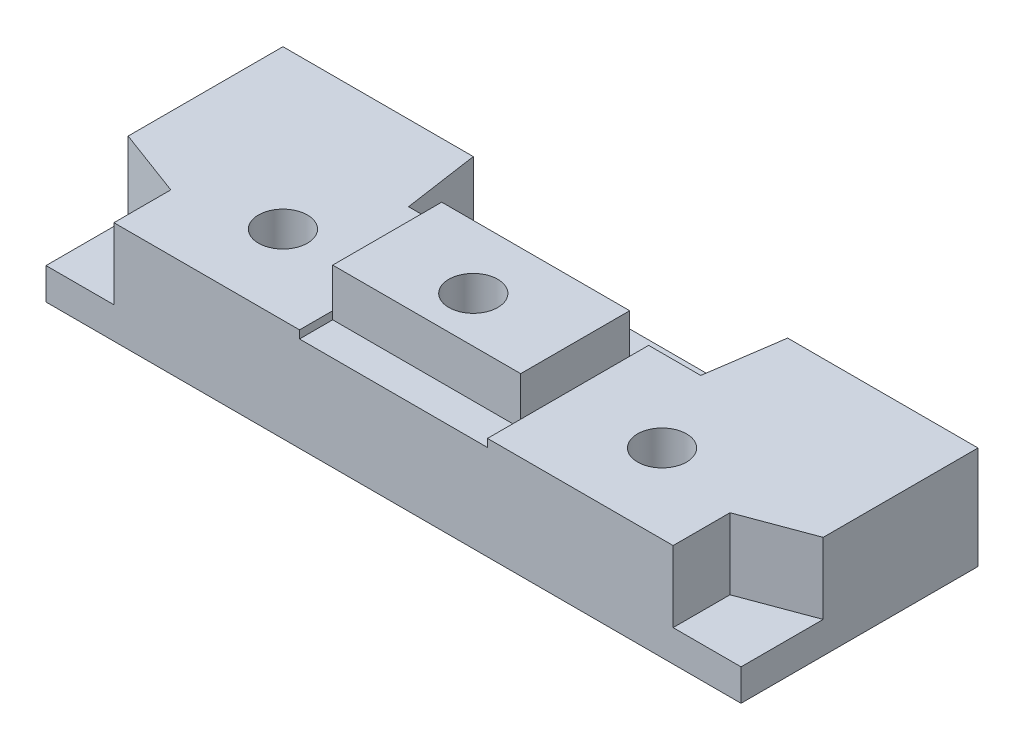
ISO-10303-21;
HEADER;
FILE_DESCRIPTION(('STEP AP214'),'2;1');
FILE_NAME('part.step','',(''),(''),'','','');
FILE_SCHEMA(('AUTOMOTIVE_DESIGN { 1 0 10303 214 1 1 1 1 }'));
ENDSEC;
DATA;
#1=APPLICATION_CONTEXT('core data for automotive mechanical design processes');
#2=APPLICATION_PROTOCOL_DEFINITION('international standard','automotive_design',2000,#1);
#3=PRODUCT_CONTEXT('',#1,'mechanical');
#4=PRODUCT('Part','Part','',(#3));
#5=PRODUCT_RELATED_PRODUCT_CATEGORY('part','',(#4));
#6=PRODUCT_DEFINITION_FORMATION('','',#4);
#7=PRODUCT_DEFINITION_CONTEXT('part definition',#1,'design');
#8=PRODUCT_DEFINITION('design','',#6,#7);
#9=PRODUCT_DEFINITION_SHAPE('','',#8);
#10=(LENGTH_UNIT() NAMED_UNIT(*) SI_UNIT(.MILLI.,.METRE.));
#11=(NAMED_UNIT(*) PLANE_ANGLE_UNIT() SI_UNIT($,.RADIAN.));
#12=(NAMED_UNIT(*) SI_UNIT($,.STERADIAN.) SOLID_ANGLE_UNIT());
#13=UNCERTAINTY_MEASURE_WITH_UNIT(LENGTH_MEASURE(1.E-05),#10,'distance_accuracy_value','');
#14=(GEOMETRIC_REPRESENTATION_CONTEXT(3) GLOBAL_UNCERTAINTY_ASSIGNED_CONTEXT((#13)) GLOBAL_UNIT_ASSIGNED_CONTEXT((#10,
#11,#12)) REPRESENTATION_CONTEXT('',''));
#15=CARTESIAN_POINT('',(0.,0.,0.));
#16=DIRECTION('',(0.,0.,1.));
#17=DIRECTION('',(1.,0.,0.));
#18=AXIS2_PLACEMENT_3D('',#15,#16,#17);
#19=CARTESIAN_POINT('',(16.05,9.,0.));
#20=DIRECTION('',(1.,0.,0.));
#21=DIRECTION('',(0.,0.,-1.));
#22=AXIS2_PLACEMENT_3D('',#19,#20,#21);
#23=PLANE('',#22);
#24=DIRECTION('',(0.,0.,1.));
#25=VECTOR('',#24,1.);
#26=CARTESIAN_POINT('',(16.05,6.5,4.80000000000001));
#27=LINE('',#26,#25);
#28=CARTESIAN_POINT('',(16.05,6.5,6.00000000000001));
#29=VERTEX_POINT('',#28);
#30=CARTESIAN_POINT('',(16.05,6.5,12.9));
#31=VERTEX_POINT('',#30);
#32=EDGE_CURVE('E310',#29,#31,#27,.T.);
#33=ORIENTED_EDGE('',*,*,#32,.T.);
#34=DIRECTION('',(0.,1.,0.));
#35=VECTOR('',#34,1.);
#36=CARTESIAN_POINT('',(16.05,6.,12.9));
#37=LINE('',#36,#35);
#38=CARTESIAN_POINT('',(16.05,9.,12.9));
#39=VERTEX_POINT('',#38);
#40=EDGE_CURVE('E335',#31,#39,#37,.T.);
#41=ORIENTED_EDGE('',*,*,#40,.T.);
#42=DIRECTION('',(0.,0.,1.));
#43=VECTOR('',#42,1.);
#44=CARTESIAN_POINT('',(16.05,9.,0.));
#45=LINE('',#44,#43);
#46=CARTESIAN_POINT('',(16.05,9.,6.00000000000001));
#47=VERTEX_POINT('',#46);
#48=EDGE_CURVE('E414',#47,#39,#45,.T.);
#49=ORIENTED_EDGE('',*,*,#48,.F.);
#50=DIRECTION('',(0.,1.,0.));
#51=VECTOR('',#50,1.);
#52=CARTESIAN_POINT('',(16.05,2.,6.00000000000001));
#53=LINE('',#52,#51);
#54=EDGE_CURVE('E347',#29,#47,#53,.T.);
#55=ORIENTED_EDGE('',*,*,#54,.F.);
#56=EDGE_LOOP('',(#33,#41,#49,#55));
#57=FACE_BOUND('',#56,.T.);
#58=ADVANCED_FACE('F87',(#57),#23,.F.);
#59=CARTESIAN_POINT('',(0.,5.,15.));
#60=DIRECTION('',(0.,0.,-1.));
#61=DIRECTION('',(-1.,0.,0.));
#62=AXIS2_PLACEMENT_3D('',#59,#60,#61);
#63=PLANE('',#62);
#64=DIRECTION('',(0.,1.,0.));
#65=VECTOR('',#64,1.);
#66=CARTESIAN_POINT('',(39.7,2.,15.));
#67=LINE('',#66,#65);
#68=CARTESIAN_POINT('',(39.7,2.,15.));
#69=VERTEX_POINT('',#68);
#70=CARTESIAN_POINT('',(39.7,6.5,15.));
#71=VERTEX_POINT('',#70);
#72=EDGE_CURVE('E251',#69,#71,#67,.T.);
#73=ORIENTED_EDGE('',*,*,#72,.T.);
#74=DIRECTION('',(1.,0.,0.));
#75=VECTOR('',#74,1.);
#76=CARTESIAN_POINT('',(27.95,6.5,15.));
#77=LINE('',#76,#75);
#78=CARTESIAN_POINT('',(27.95,6.5,15.));
#79=VERTEX_POINT('',#78);
#80=EDGE_CURVE('E255',#79,#71,#77,.T.);
#81=ORIENTED_EDGE('',*,*,#80,.F.);
#82=DIRECTION('',(0.,-1.,0.));
#83=VECTOR('',#82,1.);
#84=CARTESIAN_POINT('',(27.95,6.5,15.));
#85=LINE('',#84,#83);
#86=CARTESIAN_POINT('',(27.95,6.,15.));
#87=VERTEX_POINT('',#86);
#88=EDGE_CURVE('E273',#79,#87,#85,.T.);
#89=ORIENTED_EDGE('',*,*,#88,.T.);
#90=DIRECTION('',(1.,0.,0.));
#91=VECTOR('',#90,1.);
#92=CARTESIAN_POINT('',(16.05,6.,15.));
#93=LINE('',#92,#91);
#94=CARTESIAN_POINT('',(16.05,6.,15.));
#95=VERTEX_POINT('',#94);
#96=EDGE_CURVE('E322',#95,#87,#93,.T.);
#97=ORIENTED_EDGE('',*,*,#96,.F.);
#98=DIRECTION('',(0.,-1.,0.));
#99=VECTOR('',#98,1.);
#100=CARTESIAN_POINT('',(16.05,6.5,15.));
#101=LINE('',#100,#99);
#102=CARTESIAN_POINT('',(16.05,6.5,15.));
#103=VERTEX_POINT('',#102);
#104=EDGE_CURVE('E316',#103,#95,#101,.T.);
#105=ORIENTED_EDGE('',*,*,#104,.F.);
#106=DIRECTION('',(-1.,0.,0.));
#107=VECTOR('',#106,1.);
#108=CARTESIAN_POINT('',(16.05,6.5,15.));
#109=LINE('',#108,#107);
#110=CARTESIAN_POINT('',(4.3,6.5,15.));
#111=VERTEX_POINT('',#110);
#112=EDGE_CURVE('E309',#103,#111,#109,.T.);
#113=ORIENTED_EDGE('',*,*,#112,.T.);
#114=DIRECTION('',(0.,1.,0.));
#115=VECTOR('',#114,1.);
#116=CARTESIAN_POINT('',(4.3,2.,15.));
#117=LINE('',#116,#115);
#118=CARTESIAN_POINT('',(4.3,2.,15.));
#119=VERTEX_POINT('',#118);
#120=EDGE_CURVE('E364',#119,#111,#117,.T.);
#121=ORIENTED_EDGE('',*,*,#120,.F.);
#122=DIRECTION('',(1.,0.,0.));
#123=VECTOR('',#122,1.);
#124=CARTESIAN_POINT('',(0.,2.,15.));
#125=LINE('',#124,#123);
#126=CARTESIAN_POINT('',(0.,2.,15.));
#127=VERTEX_POINT('',#126);
#128=EDGE_CURVE('E357',#127,#119,#125,.T.);
#129=ORIENTED_EDGE('',*,*,#128,.F.);
#130=DIRECTION('',(0.,-1.,0.));
#131=VECTOR('',#130,1.);
#132=CARTESIAN_POINT('',(0.,5.,15.));
#133=LINE('',#132,#131);
#134=CARTESIAN_POINT('',(0.,0.,15.));
#135=VERTEX_POINT('',#134);
#136=EDGE_CURVE('E12',#127,#135,#133,.T.);
#137=ORIENTED_EDGE('',*,*,#136,.T.);
#138=DIRECTION('',(1.,0.,0.));
#139=VECTOR('',#138,1.);
#140=CARTESIAN_POINT('',(0.,0.,15.));
#141=LINE('',#140,#139);
#142=CARTESIAN_POINT('',(44.,0.,15.));
#143=VERTEX_POINT('',#142);
#144=EDGE_CURVE('E425',#135,#143,#141,.T.);
#145=ORIENTED_EDGE('',*,*,#144,.T.);
#146=DIRECTION('',(0.,-1.,0.));
#147=VECTOR('',#146,1.);
#148=CARTESIAN_POINT('',(44.,5.,15.));
#149=LINE('',#148,#147);
#150=CARTESIAN_POINT('',(44.,2.,15.));
#151=VERTEX_POINT('',#150);
#152=EDGE_CURVE('E95',#151,#143,#149,.T.);
#153=ORIENTED_EDGE('',*,*,#152,.F.);
#154=DIRECTION('',(1.,0.,0.));
#155=VECTOR('',#154,1.);
#156=CARTESIAN_POINT('',(44.,2.,15.));
#157=LINE('',#156,#155);
#158=EDGE_CURVE('E257',#69,#151,#157,.T.);
#159=ORIENTED_EDGE('',*,*,#158,.F.);
#160=EDGE_LOOP('',(#73,#81,#89,#97,#105,#113,#121,#129,#137,#145,#153,#159));
#161=FACE_BOUND('',#160,.T.);
#162=ADVANCED_FACE('F253',(#161),#63,.F.);
#163=CARTESIAN_POINT('',(0.,5.,0.));
#164=DIRECTION('',(0.,0.,1.));
#165=DIRECTION('',(1.,0.,0.));
#166=AXIS2_PLACEMENT_3D('',#163,#164,#165);
#167=PLANE('',#166);
#168=DIRECTION('',(0.,1.,0.));
#169=VECTOR('',#168,1.);
#170=CARTESIAN_POINT('',(12.05,2.,0.));
#171=LINE('',#170,#169);
#172=CARTESIAN_POINT('',(12.05,2.,0.));
#173=VERTEX_POINT('',#172);
#174=CARTESIAN_POINT('',(12.05,6.5,0.));
#175=VERTEX_POINT('',#174);
#176=EDGE_CURVE('E398',#173,#175,#171,.T.);
#177=ORIENTED_EDGE('',*,*,#176,.F.);
#178=DIRECTION('',(-1.,0.,0.));
#179=VECTOR('',#178,1.);
#180=CARTESIAN_POINT('',(31.95,2.,0.));
#181=LINE('',#180,#179);
#182=CARTESIAN_POINT('',(31.95,2.,0.));
#183=VERTEX_POINT('',#182);
#184=EDGE_CURVE('E383',#183,#173,#181,.T.);
#185=ORIENTED_EDGE('',*,*,#184,.F.);
#186=DIRECTION('',(0.,1.,0.));
#187=VECTOR('',#186,1.);
#188=CARTESIAN_POINT('',(31.95,2.,0.));
#189=LINE('',#188,#187);
#190=CARTESIAN_POINT('',(31.95,6.5,0.));
#191=VERTEX_POINT('',#190);
#192=EDGE_CURVE('E388',#183,#191,#189,.T.);
#193=ORIENTED_EDGE('',*,*,#192,.T.);
#194=DIRECTION('',(-1.,0.,0.));
#195=VECTOR('',#194,1.);
#196=CARTESIAN_POINT('',(44.,6.5,0.));
#197=LINE('',#196,#195);
#198=CARTESIAN_POINT('',(44.,6.5,0.));
#199=VERTEX_POINT('',#198);
#200=EDGE_CURVE('E508',#199,#191,#197,.T.);
#201=ORIENTED_EDGE('',*,*,#200,.F.);
#202=DIRECTION('',(0.,-1.,0.));
#203=VECTOR('',#202,1.);
#204=CARTESIAN_POINT('',(44.,5.,0.));
#205=LINE('',#204,#203);
#206=CARTESIAN_POINT('',(44.,0.,0.));
#207=VERTEX_POINT('',#206);
#208=EDGE_CURVE('E435',#199,#207,#205,.T.);
#209=ORIENTED_EDGE('',*,*,#208,.T.);
#210=DIRECTION('',(-1.,0.,0.));
#211=VECTOR('',#210,1.);
#212=CARTESIAN_POINT('',(0.,0.,0.));
#213=LINE('',#212,#211);
#214=CARTESIAN_POINT('',(0.,0.,0.));
#215=VERTEX_POINT('',#214);
#216=EDGE_CURVE('E430',#207,#215,#213,.T.);
#217=ORIENTED_EDGE('',*,*,#216,.T.);
#218=DIRECTION('',(0.,-1.,0.));
#219=VECTOR('',#218,1.);
#220=CARTESIAN_POINT('',(0.,5.,0.));
#221=LINE('',#220,#219);
#222=CARTESIAN_POINT('',(0.,6.5,0.));
#223=VERTEX_POINT('',#222);
#224=EDGE_CURVE('E432',#223,#215,#221,.T.);
#225=ORIENTED_EDGE('',*,*,#224,.F.);
#226=DIRECTION('',(1.,0.,0.));
#227=VECTOR('',#226,1.);
#228=CARTESIAN_POINT('',(0.,6.5,0.));
#229=LINE('',#228,#227);
#230=EDGE_CURVE('E296',#223,#175,#229,.T.);
#231=ORIENTED_EDGE('',*,*,#230,.T.);
#232=EDGE_LOOP('',(#177,#185,#193,#201,#209,#217,#225,#231));
#233=FACE_BOUND('',#232,.T.);
#234=ADVANCED_FACE('F450',(#233),#167,.F.);
#235=CARTESIAN_POINT('',(0.,5.,0.));
#236=DIRECTION('',(1.,0.,0.));
#237=DIRECTION('',(0.,0.,-1.));
#238=AXIS2_PLACEMENT_3D('',#235,#236,#237);
#239=PLANE('',#238);
#240=DIRECTION('',(0.,0.,1.));
#241=VECTOR('',#240,1.);
#242=CARTESIAN_POINT('',(0.,2.,9.8));
#243=LINE('',#242,#241);
#244=CARTESIAN_POINT('',(0.,2.,9.8));
#245=VERTEX_POINT('',#244);
#246=EDGE_CURVE('E110',#245,#127,#243,.T.);
#247=ORIENTED_EDGE('',*,*,#246,.F.);
#248=DIRECTION('',(0.,1.,0.));
#249=VECTOR('',#248,1.);
#250=CARTESIAN_POINT('',(0.,2.,9.8));
#251=LINE('',#250,#249);
#252=CARTESIAN_POINT('',(0.,6.5,9.8));
#253=VERTEX_POINT('',#252);
#254=EDGE_CURVE('E365',#245,#253,#251,.T.);
#255=ORIENTED_EDGE('',*,*,#254,.T.);
#256=DIRECTION('',(0.,0.,-1.));
#257=VECTOR('',#256,1.);
#258=CARTESIAN_POINT('',(0.,6.5,9.8));
#259=LINE('',#258,#257);
#260=EDGE_CURVE('E293',#253,#223,#259,.T.);
#261=ORIENTED_EDGE('',*,*,#260,.T.);
#262=ORIENTED_EDGE('',*,*,#224,.T.);
#263=DIRECTION('',(0.,0.,1.));
#264=VECTOR('',#263,1.);
#265=CARTESIAN_POINT('',(0.,0.,0.));
#266=LINE('',#265,#264);
#267=EDGE_CURVE('E422',#215,#135,#266,.T.);
#268=ORIENTED_EDGE('',*,*,#267,.T.);
#269=ORIENTED_EDGE('',*,*,#136,.F.);
#270=EDGE_LOOP('',(#247,#255,#261,#262,#268,#269));
#271=FACE_BOUND('',#270,.T.);
#272=ADVANCED_FACE('F89',(#271),#239,.F.);
#273=CARTESIAN_POINT('',(44.,5.,0.));
#274=DIRECTION('',(-1.,0.,0.));
#275=DIRECTION('',(0.,0.,1.));
#276=AXIS2_PLACEMENT_3D('',#273,#274,#275);
#277=PLANE('',#276);
#278=ORIENTED_EDGE('',*,*,#208,.F.);
#279=DIRECTION('',(0.,0.,-1.));
#280=VECTOR('',#279,1.);
#281=CARTESIAN_POINT('',(44.,6.5,9.79999999999998));
#282=LINE('',#281,#280);
#283=CARTESIAN_POINT('',(44.,6.5,9.79999999999998));
#284=VERTEX_POINT('',#283);
#285=EDGE_CURVE('E284',#284,#199,#282,.T.);
#286=ORIENTED_EDGE('',*,*,#285,.F.);
#287=DIRECTION('',(0.,1.,0.));
#288=VECTOR('',#287,1.);
#289=CARTESIAN_POINT('',(44.,2.,9.79999999999998));
#290=LINE('',#289,#288);
#291=CARTESIAN_POINT('',(44.,2.,9.79999999999998));
#292=VERTEX_POINT('',#291);
#293=EDGE_CURVE('E262',#292,#284,#290,.T.);
#294=ORIENTED_EDGE('',*,*,#293,.F.);
#295=DIRECTION('',(0.,0.,-1.));
#296=VECTOR('',#295,1.);
#297=CARTESIAN_POINT('',(44.,2.,9.79999999999998));
#298=LINE('',#297,#296);
#299=EDGE_CURVE('E375',#151,#292,#298,.T.);
#300=ORIENTED_EDGE('',*,*,#299,.F.);
#301=ORIENTED_EDGE('',*,*,#152,.T.);
#302=DIRECTION('',(0.,0.,-1.));
#303=VECTOR('',#302,1.);
#304=CARTESIAN_POINT('',(44.,0.,0.));
#305=LINE('',#304,#303);
#306=EDGE_CURVE('E428',#143,#207,#305,.T.);
#307=ORIENTED_EDGE('',*,*,#306,.T.);
#308=EDGE_LOOP('',(#278,#286,#294,#300,#301,#307));
#309=FACE_BOUND('',#308,.T.);
#310=ADVANCED_FACE('F439',(#309),#277,.F.);
#311=CARTESIAN_POINT('',(0.,0.,0.));
#312=DIRECTION('',(0.,1.,0.));
#313=DIRECTION('',(0.,0.,1.));
#314=AXIS2_PLACEMENT_3D('',#311,#312,#313);
#315=PLANE('',#314);
#316=ORIENTED_EDGE('',*,*,#267,.F.);
#317=ORIENTED_EDGE('',*,*,#216,.F.);
#318=ORIENTED_EDGE('',*,*,#306,.F.);
#319=ORIENTED_EDGE('',*,*,#144,.F.);
#320=EDGE_LOOP('',(#316,#317,#318,#319));
#321=FACE_BOUND('',#320,.T.);
#322=ADVANCED_FACE('F447',(#321),#315,.F.);
#323=CARTESIAN_POINT('',(27.95,9.,0.));
#324=DIRECTION('',(-1.,0.,0.));
#325=DIRECTION('',(0.,0.,1.));
#326=AXIS2_PLACEMENT_3D('',#323,#324,#325);
#327=PLANE('',#326);
#328=DIRECTION('',(0.,1.,0.));
#329=VECTOR('',#328,1.);
#330=CARTESIAN_POINT('',(27.95,6.,12.9));
#331=LINE('',#330,#329);
#332=CARTESIAN_POINT('',(27.95,6.5,12.9));
#333=VERTEX_POINT('',#332);
#334=CARTESIAN_POINT('',(27.95,9.,12.9));
#335=VERTEX_POINT('',#334);
#336=EDGE_CURVE('E102',#333,#335,#331,.T.);
#337=ORIENTED_EDGE('',*,*,#336,.F.);
#338=DIRECTION('',(0.,0.,1.));
#339=VECTOR('',#338,1.);
#340=CARTESIAN_POINT('',(27.95,6.5,4.8));
#341=LINE('',#340,#339);
#342=CARTESIAN_POINT('',(27.95,6.5,6.00000000000001));
#343=VERTEX_POINT('',#342);
#344=EDGE_CURVE('E496',#343,#333,#341,.T.);
#345=ORIENTED_EDGE('',*,*,#344,.F.);
#346=DIRECTION('',(0.,1.,0.));
#347=VECTOR('',#346,1.);
#348=CARTESIAN_POINT('',(27.95,2.,6.00000000000001));
#349=LINE('',#348,#347);
#350=CARTESIAN_POINT('',(27.95,9.,6.00000000000001));
#351=VERTEX_POINT('',#350);
#352=EDGE_CURVE('E353',#343,#351,#349,.T.);
#353=ORIENTED_EDGE('',*,*,#352,.T.);
#354=DIRECTION('',(0.,0.,-1.));
#355=VECTOR('',#354,1.);
#356=CARTESIAN_POINT('',(27.95,9.,0.));
#357=LINE('',#356,#355);
#358=EDGE_CURVE('E419',#335,#351,#357,.T.);
#359=ORIENTED_EDGE('',*,*,#358,.F.);
#360=EDGE_LOOP('',(#337,#345,#353,#359));
#361=FACE_BOUND('',#360,.T.);
#362=ADVANCED_FACE('F495',(#361),#327,.F.);
#363=CARTESIAN_POINT('',(0.,9.,0.));
#364=DIRECTION('',(0.,1.,0.));
#365=DIRECTION('',(0.,0.,1.));
#366=AXIS2_PLACEMENT_3D('',#363,#364,#365);
#367=PLANE('',#366);
#368=DIRECTION('',(-1.,0.,0.));
#369=VECTOR('',#368,1.);
#370=CARTESIAN_POINT('',(16.05,9.,12.9));
#371=LINE('',#370,#369);
#372=EDGE_CURVE('E318',#335,#39,#371,.T.);
#373=ORIENTED_EDGE('',*,*,#372,.F.);
#374=ORIENTED_EDGE('',*,*,#358,.T.);
#375=DIRECTION('',(1.,0.,0.));
#376=VECTOR('',#375,1.);
#377=CARTESIAN_POINT('',(16.05,9.,6.00000000000001));
#378=LINE('',#377,#376);
#379=EDGE_CURVE('E334',#47,#351,#378,.T.);
#380=ORIENTED_EDGE('',*,*,#379,.F.);
#381=ORIENTED_EDGE('',*,*,#48,.T.);
#382=EDGE_LOOP('',(#373,#374,#380,#381));
#383=FACE_BOUND('',#382,.T.);
#384=CARTESIAN_POINT('',(22.05,9.,10.));
#385=DIRECTION('',(0.,1.,0.));
#386=DIRECTION('',(0.,0.,1.));
#387=AXIS2_PLACEMENT_3D('',#384,#385,#386);
#388=CIRCLE('',#387,1.55);
#389=CARTESIAN_POINT('',(22.05,9.,11.55));
#390=VERTEX_POINT('',#389);
#391=EDGE_CURVE('E401',#390,#390,#388,.T.);
#392=ORIENTED_EDGE('',*,*,#391,.F.);
#393=EDGE_LOOP('',(#392));
#394=FACE_BOUND('',#393,.T.);
#395=ADVANCED_FACE('F486',(#383,#394),#367,.T.);
#396=CARTESIAN_POINT('',(22.05,6.,10.));
#397=DIRECTION('',(0.,1.,0.));
#398=DIRECTION('',(0.,0.,1.));
#399=AXIS2_PLACEMENT_3D('',#396,#397,#398);
#400=CYLINDRICAL_SURFACE('',#399,1.55);
#401=CARTESIAN_POINT('',(22.05,6.,10.));
#402=DIRECTION('',(0.,1.,0.));
#403=DIRECTION('',(0.,0.,1.));
#404=AXIS2_PLACEMENT_3D('',#401,#402,#403);
#405=CIRCLE('',#404,1.55);
#406=CARTESIAN_POINT('',(22.05,6.,11.55));
#407=VERTEX_POINT('',#406);
#408=EDGE_CURVE('E405',#407,#407,#405,.T.);
#409=ORIENTED_EDGE('',*,*,#408,.F.);
#410=EDGE_LOOP('',(#409));
#411=FACE_BOUND('',#410,.T.);
#412=ORIENTED_EDGE('',*,*,#391,.T.);
#413=EDGE_LOOP('',(#412));
#414=FACE_BOUND('',#413,.T.);
#415=ADVANCED_FACE('F588',(#411,#414),#400,.F.);
#416=CARTESIAN_POINT('',(22.05,6.,10.));
#417=DIRECTION('',(0.,1.,0.));
#418=DIRECTION('',(0.,0.,1.));
#419=AXIS2_PLACEMENT_3D('',#416,#417,#418);
#420=PLANE('',#419);
#421=ORIENTED_EDGE('',*,*,#408,.T.);
#422=EDGE_LOOP('',(#421));
#423=FACE_BOUND('',#422,.T.);
#424=ADVANCED_FACE('F633',(#423),#420,.T.);
#425=CARTESIAN_POINT('',(31.25,2.,4.8));
#426=DIRECTION('',(0.989532981063281,0.,0.144306893071728));
#427=DIRECTION('',(0.144306893071728,0.,-0.989532981063282));
#428=AXIS2_PLACEMENT_3D('',#425,#426,#427);
#429=PLANE('',#428);
#430=DIRECTION('',(0.,1.,0.));
#431=VECTOR('',#430,1.);
#432=CARTESIAN_POINT('',(31.25,2.,4.8));
#433=LINE('',#432,#431);
#434=CARTESIAN_POINT('',(31.25,2.,4.8));
#435=VERTEX_POINT('',#434);
#436=CARTESIAN_POINT('',(31.25,6.5,4.8));
#437=VERTEX_POINT('',#436);
#438=EDGE_CURVE('E373',#435,#437,#433,.T.);
#439=ORIENTED_EDGE('',*,*,#438,.T.);
#440=DIRECTION('',(-0.144306893071728,0.,0.989532981063281));
#441=VECTOR('',#440,1.);
#442=CARTESIAN_POINT('',(31.95,6.5,0.));
#443=LINE('',#442,#441);
#444=EDGE_CURVE('E505',#191,#437,#443,.T.);
#445=ORIENTED_EDGE('',*,*,#444,.F.);
#446=ORIENTED_EDGE('',*,*,#192,.F.);
#447=DIRECTION('',(0.144306893071728,0.,-0.989532981063281));
#448=VECTOR('',#447,1.);
#449=CARTESIAN_POINT('',(31.25,2.,4.8));
#450=LINE('',#449,#448);
#451=EDGE_CURVE('E352',#435,#183,#450,.T.);
#452=ORIENTED_EDGE('',*,*,#451,.F.);
#453=EDGE_LOOP('',(#439,#445,#446,#452));
#454=FACE_BOUND('',#453,.T.);
#455=ADVANCED_FACE('F516',(#454),#429,.F.);
#456=CARTESIAN_POINT('',(27.95,2.,4.8));
#457=DIRECTION('',(0.,0.,1.));
#458=DIRECTION('',(1.,0.,0.));
#459=AXIS2_PLACEMENT_3D('',#456,#457,#458);
#460=PLANE('',#459);
#461=DIRECTION('',(0.,1.,0.));
#462=VECTOR('',#461,1.);
#463=CARTESIAN_POINT('',(27.95,2.,4.8));
#464=LINE('',#463,#462);
#465=CARTESIAN_POINT('',(27.95,2.,4.8));
#466=VERTEX_POINT('',#465);
#467=CARTESIAN_POINT('',(27.95,6.5,4.8));
#468=VERTEX_POINT('',#467);
#469=EDGE_CURVE('E390',#466,#468,#464,.T.);
#470=ORIENTED_EDGE('',*,*,#469,.T.);
#471=DIRECTION('',(-1.,0.,0.));
#472=VECTOR('',#471,1.);
#473=CARTESIAN_POINT('',(31.25,6.5,4.8));
#474=LINE('',#473,#472);
#475=EDGE_CURVE('E500',#437,#468,#474,.T.);
#476=ORIENTED_EDGE('',*,*,#475,.F.);
#477=ORIENTED_EDGE('',*,*,#438,.F.);
#478=DIRECTION('',(1.,0.,0.));
#479=VECTOR('',#478,1.);
#480=CARTESIAN_POINT('',(27.95,2.,4.8));
#481=LINE('',#480,#479);
#482=EDGE_CURVE('E385',#466,#435,#481,.T.);
#483=ORIENTED_EDGE('',*,*,#482,.F.);
#484=EDGE_LOOP('',(#470,#476,#477,#483));
#485=FACE_BOUND('',#484,.T.);
#486=ADVANCED_FACE('F523',(#485),#460,.F.);
#487=CARTESIAN_POINT('',(0.,2.,0.));
#488=DIRECTION('',(0.,1.,0.));
#489=DIRECTION('',(0.,0.,1.));
#490=AXIS2_PLACEMENT_3D('',#487,#488,#489);
#491=PLANE('',#490);
#492=ORIENTED_EDGE('',*,*,#451,.T.);
#493=ORIENTED_EDGE('',*,*,#184,.T.);
#494=DIRECTION('',(0.144306893071729,0.,0.989532981063281));
#495=VECTOR('',#494,1.);
#496=CARTESIAN_POINT('',(12.75,2.,4.80000000000001));
#497=LINE('',#496,#495);
#498=CARTESIAN_POINT('',(12.75,2.,4.80000000000001));
#499=VERTEX_POINT('',#498);
#500=EDGE_CURVE('E367',#173,#499,#497,.T.);
#501=ORIENTED_EDGE('',*,*,#500,.T.);
#502=DIRECTION('',(1.,0.,0.));
#503=VECTOR('',#502,1.);
#504=CARTESIAN_POINT('',(16.05,2.,4.80000000000001));
#505=LINE('',#504,#503);
#506=CARTESIAN_POINT('',(16.05,2.,4.80000000000001));
#507=VERTEX_POINT('',#506);
#508=EDGE_CURVE('E395',#499,#507,#505,.T.);
#509=ORIENTED_EDGE('',*,*,#508,.T.);
#510=DIRECTION('',(0.,0.,1.));
#511=VECTOR('',#510,1.);
#512=CARTESIAN_POINT('',(16.05,2.,0.));
#513=LINE('',#512,#511);
#514=CARTESIAN_POINT('',(16.05,2.,6.00000000000001));
#515=VERTEX_POINT('',#514);
#516=EDGE_CURVE('E338',#507,#515,#513,.T.);
#517=ORIENTED_EDGE('',*,*,#516,.T.);
#518=DIRECTION('',(1.,0.,0.));
#519=VECTOR('',#518,1.);
#520=CARTESIAN_POINT('',(16.05,2.,6.00000000000001));
#521=LINE('',#520,#519);
#522=CARTESIAN_POINT('',(27.95,2.,6.00000000000001));
#523=VERTEX_POINT('',#522);
#524=EDGE_CURVE('E341',#515,#523,#521,.T.);
#525=ORIENTED_EDGE('',*,*,#524,.T.);
#526=DIRECTION('',(0.,0.,-1.));
#527=VECTOR('',#526,1.);
#528=CARTESIAN_POINT('',(27.95,2.,0.));
#529=LINE('',#528,#527);
#530=EDGE_CURVE('E344',#523,#466,#529,.T.);
#531=ORIENTED_EDGE('',*,*,#530,.T.);
#532=ORIENTED_EDGE('',*,*,#482,.T.);
#533=EDGE_LOOP('',(#492,#493,#501,#509,#517,#525,#531,#532));
#534=FACE_BOUND('',#533,.T.);
#535=ADVANCED_FACE('F518',(#534),#491,.T.);
#536=CARTESIAN_POINT('',(16.05,2.,4.80000000000001));
#537=DIRECTION('',(0.,0.,1.));
#538=DIRECTION('',(1.,0.,0.));
#539=AXIS2_PLACEMENT_3D('',#536,#537,#538);
#540=PLANE('',#539);
#541=DIRECTION('',(0.,1.,0.));
#542=VECTOR('',#541,1.);
#543=CARTESIAN_POINT('',(12.75,2.,4.80000000000001));
#544=LINE('',#543,#542);
#545=CARTESIAN_POINT('',(12.75,6.5,4.80000000000001));
#546=VERTEX_POINT('',#545);
#547=EDGE_CURVE('E402',#499,#546,#544,.T.);
#548=ORIENTED_EDGE('',*,*,#547,.T.);
#549=DIRECTION('',(1.,0.,0.));
#550=VECTOR('',#549,1.);
#551=CARTESIAN_POINT('',(12.75,6.5,4.80000000000001));
#552=LINE('',#551,#550);
#553=CARTESIAN_POINT('',(16.05,6.5,4.80000000000001));
#554=VERTEX_POINT('',#553);
#555=EDGE_CURVE('E302',#546,#554,#552,.T.);
#556=ORIENTED_EDGE('',*,*,#555,.T.);
#557=DIRECTION('',(0.,1.,0.));
#558=VECTOR('',#557,1.);
#559=CARTESIAN_POINT('',(16.05,2.,4.80000000000001));
#560=LINE('',#559,#558);
#561=EDGE_CURVE('E399',#507,#554,#560,.T.);
#562=ORIENTED_EDGE('',*,*,#561,.F.);
#563=ORIENTED_EDGE('',*,*,#508,.F.);
#564=EDGE_LOOP('',(#548,#556,#562,#563));
#565=FACE_BOUND('',#564,.T.);
#566=ADVANCED_FACE('F532',(#565),#540,.F.);
#567=CARTESIAN_POINT('',(12.75,2.,4.80000000000001));
#568=DIRECTION('',(-0.989532981063281,0.,0.144306893071729));
#569=DIRECTION('',(0.144306893071729,0.,0.989532981063281));
#570=AXIS2_PLACEMENT_3D('',#567,#568,#569);
#571=PLANE('',#570);
#572=ORIENTED_EDGE('',*,*,#176,.T.);
#573=DIRECTION('',(0.144306893071729,0.,0.989532981063281));
#574=VECTOR('',#573,1.);
#575=CARTESIAN_POINT('',(12.05,6.5,0.));
#576=LINE('',#575,#574);
#577=EDGE_CURVE('E299',#175,#546,#576,.T.);
#578=ORIENTED_EDGE('',*,*,#577,.T.);
#579=ORIENTED_EDGE('',*,*,#547,.F.);
#580=ORIENTED_EDGE('',*,*,#500,.F.);
#581=EDGE_LOOP('',(#572,#578,#579,#580));
#582=FACE_BOUND('',#581,.T.);
#583=ADVANCED_FACE('F535',(#582),#571,.F.);
#584=CARTESIAN_POINT('',(39.7,2.,15.));
#585=DIRECTION('',(-1.,0.,0.));
#586=DIRECTION('',(0.,0.,1.));
#587=AXIS2_PLACEMENT_3D('',#584,#585,#586);
#588=PLANE('',#587);
#589=DIRECTION('',(0.,1.,0.));
#590=VECTOR('',#589,1.);
#591=CARTESIAN_POINT('',(39.7,2.,11.4));
#592=LINE('',#591,#590);
#593=CARTESIAN_POINT('',(39.7,2.,11.4));
#594=VERTEX_POINT('',#593);
#595=CARTESIAN_POINT('',(39.7,6.5,11.4));
#596=VERTEX_POINT('',#595);
#597=EDGE_CURVE('E276',#594,#596,#592,.T.);
#598=ORIENTED_EDGE('',*,*,#597,.T.);
#599=DIRECTION('',(0.,0.,-1.));
#600=VECTOR('',#599,1.);
#601=CARTESIAN_POINT('',(39.7,6.5,15.));
#602=LINE('',#601,#600);
#603=EDGE_CURVE('E269',#71,#596,#602,.T.);
#604=ORIENTED_EDGE('',*,*,#603,.F.);
#605=ORIENTED_EDGE('',*,*,#72,.F.);
#606=DIRECTION('',(0.,0.,1.));
#607=VECTOR('',#606,1.);
#608=CARTESIAN_POINT('',(39.7,2.,15.));
#609=LINE('',#608,#607);
#610=EDGE_CURVE('E371',#594,#69,#609,.T.);
#611=ORIENTED_EDGE('',*,*,#610,.F.);
#612=EDGE_LOOP('',(#598,#604,#605,#611));
#613=FACE_BOUND('',#612,.T.);
#614=ADVANCED_FACE('F275',(#613),#588,.F.);
#615=CARTESIAN_POINT('',(39.7,2.,11.4));
#616=DIRECTION('',(-0.348733712021419,0.,-0.937221851057562));
#617=DIRECTION('',(-0.937221851057562,0.,0.348733712021419));
#618=AXIS2_PLACEMENT_3D('',#615,#616,#617);
#619=PLANE('',#618);
#620=ORIENTED_EDGE('',*,*,#293,.T.);
#621=DIRECTION('',(0.937221851057562,0.,-0.348733712021419));
#622=VECTOR('',#621,1.);
#623=CARTESIAN_POINT('',(39.7,6.5,11.4));
#624=LINE('',#623,#622);
#625=EDGE_CURVE('E279',#596,#284,#624,.T.);
#626=ORIENTED_EDGE('',*,*,#625,.F.);
#627=ORIENTED_EDGE('',*,*,#597,.F.);
#628=DIRECTION('',(-0.937221851057562,0.,0.348733712021419));
#629=VECTOR('',#628,1.);
#630=CARTESIAN_POINT('',(39.7,2.,11.4));
#631=LINE('',#630,#629);
#632=EDGE_CURVE('E263',#292,#594,#631,.T.);
#633=ORIENTED_EDGE('',*,*,#632,.F.);
#634=EDGE_LOOP('',(#620,#626,#627,#633));
#635=FACE_BOUND('',#634,.T.);
#636=ADVANCED_FACE('F542',(#635),#619,.F.);
#637=CARTESIAN_POINT('',(0.,2.,0.));
#638=DIRECTION('',(0.,1.,0.));
#639=DIRECTION('',(0.,0.,1.));
#640=AXIS2_PLACEMENT_3D('',#637,#638,#639);
#641=PLANE('',#640);
#642=ORIENTED_EDGE('',*,*,#610,.T.);
#643=ORIENTED_EDGE('',*,*,#158,.T.);
#644=ORIENTED_EDGE('',*,*,#299,.T.);
#645=ORIENTED_EDGE('',*,*,#632,.T.);
#646=EDGE_LOOP('',(#642,#643,#644,#645));
#647=FACE_BOUND('',#646,.T.);
#648=ADVANCED_FACE('F619',(#647),#641,.T.);
#649=CARTESIAN_POINT('',(4.3,2.,11.4));
#650=DIRECTION('',(0.348733712021418,0.,-0.937221851057562));
#651=DIRECTION('',(-0.937221851057562,0.,-0.348733712021418));
#652=AXIS2_PLACEMENT_3D('',#649,#650,#651);
#653=PLANE('',#652);
#654=DIRECTION('',(0.,1.,0.));
#655=VECTOR('',#654,1.);
#656=CARTESIAN_POINT('',(4.3,2.,11.4));
#657=LINE('',#656,#655);
#658=CARTESIAN_POINT('',(4.3,2.,11.4));
#659=VERTEX_POINT('',#658);
#660=CARTESIAN_POINT('',(4.3,6.5,11.4));
#661=VERTEX_POINT('',#660);
#662=EDGE_CURVE('E368',#659,#661,#657,.T.);
#663=ORIENTED_EDGE('',*,*,#662,.T.);
#664=DIRECTION('',(-0.937221851057562,0.,-0.348733712021418));
#665=VECTOR('',#664,1.);
#666=CARTESIAN_POINT('',(4.3,6.5,11.4));
#667=LINE('',#666,#665);
#668=EDGE_CURVE('E290',#661,#253,#667,.T.);
#669=ORIENTED_EDGE('',*,*,#668,.T.);
#670=ORIENTED_EDGE('',*,*,#254,.F.);
#671=DIRECTION('',(-0.937221851057562,0.,-0.348733712021418));
#672=VECTOR('',#671,1.);
#673=CARTESIAN_POINT('',(4.3,2.,11.4));
#674=LINE('',#673,#672);
#675=EDGE_CURVE('E362',#659,#245,#674,.T.);
#676=ORIENTED_EDGE('',*,*,#675,.F.);
#677=EDGE_LOOP('',(#663,#669,#670,#676));
#678=FACE_BOUND('',#677,.T.);
#679=ADVANCED_FACE('F462',(#678),#653,.F.);
#680=CARTESIAN_POINT('',(4.3,2.,15.));
#681=DIRECTION('',(1.,0.,0.));
#682=DIRECTION('',(0.,0.,-1.));
#683=AXIS2_PLACEMENT_3D('',#680,#681,#682);
#684=PLANE('',#683);
#685=ORIENTED_EDGE('',*,*,#120,.T.);
#686=DIRECTION('',(0.,0.,-1.));
#687=VECTOR('',#686,1.);
#688=CARTESIAN_POINT('',(4.3,6.5,15.));
#689=LINE('',#688,#687);
#690=EDGE_CURVE('E313',#111,#661,#689,.T.);
#691=ORIENTED_EDGE('',*,*,#690,.T.);
#692=ORIENTED_EDGE('',*,*,#662,.F.);
#693=DIRECTION('',(0.,0.,-1.));
#694=VECTOR('',#693,1.);
#695=CARTESIAN_POINT('',(4.3,2.,15.));
#696=LINE('',#695,#694);
#697=EDGE_CURVE('E359',#119,#659,#696,.T.);
#698=ORIENTED_EDGE('',*,*,#697,.F.);
#699=EDGE_LOOP('',(#685,#691,#692,#698));
#700=FACE_BOUND('',#699,.T.);
#701=ADVANCED_FACE('F465',(#700),#684,.F.);
#702=CARTESIAN_POINT('',(0.,2.,0.));
#703=DIRECTION('',(0.,1.,0.));
#704=DIRECTION('',(0.,0.,1.));
#705=AXIS2_PLACEMENT_3D('',#702,#703,#704);
#706=PLANE('',#705);
#707=ORIENTED_EDGE('',*,*,#246,.T.);
#708=ORIENTED_EDGE('',*,*,#128,.T.);
#709=ORIENTED_EDGE('',*,*,#697,.T.);
#710=ORIENTED_EDGE('',*,*,#675,.T.);
#711=EDGE_LOOP('',(#707,#708,#709,#710));
#712=FACE_BOUND('',#711,.T.);
#713=ADVANCED_FACE('F466',(#712),#706,.T.);
#714=CARTESIAN_POINT('',(16.05,2.,0.));
#715=DIRECTION('',(-1.,0.,0.));
#716=DIRECTION('',(0.,0.,1.));
#717=AXIS2_PLACEMENT_3D('',#714,#715,#716);
#718=PLANE('',#717);
#719=ORIENTED_EDGE('',*,*,#561,.T.);
#720=EDGE_CURVE('E306',#554,#29,#27,.T.);
#721=ORIENTED_EDGE('',*,*,#720,.T.);
#722=EDGE_CURVE('E355',#515,#29,#53,.T.);
#723=ORIENTED_EDGE('',*,*,#722,.F.);
#724=ORIENTED_EDGE('',*,*,#516,.F.);
#725=EDGE_LOOP('',(#719,#721,#723,#724));
#726=FACE_BOUND('',#725,.T.);
#727=ADVANCED_FACE('F530',(#726),#718,.F.);
#728=CARTESIAN_POINT('',(27.95,2.,0.));
#729=DIRECTION('',(1.,0.,0.));
#730=DIRECTION('',(0.,0.,-1.));
#731=AXIS2_PLACEMENT_3D('',#728,#729,#730);
#732=PLANE('',#731);
#733=EDGE_CURVE('E350',#523,#343,#349,.T.);
#734=ORIENTED_EDGE('',*,*,#733,.T.);
#735=EDGE_CURVE('E498',#468,#343,#341,.T.);
#736=ORIENTED_EDGE('',*,*,#735,.F.);
#737=ORIENTED_EDGE('',*,*,#469,.F.);
#738=ORIENTED_EDGE('',*,*,#530,.F.);
#739=EDGE_LOOP('',(#734,#736,#737,#738));
#740=FACE_BOUND('',#739,.T.);
#741=ADVANCED_FACE('F527',(#740),#732,.F.);
#742=CARTESIAN_POINT('',(16.05,2.,6.00000000000001));
#743=DIRECTION('',(0.,0.,1.));
#744=DIRECTION('',(1.,0.,0.));
#745=AXIS2_PLACEMENT_3D('',#742,#743,#744);
#746=PLANE('',#745);
#747=ORIENTED_EDGE('',*,*,#379,.T.);
#748=ORIENTED_EDGE('',*,*,#352,.F.);
#749=ORIENTED_EDGE('',*,*,#733,.F.);
#750=ORIENTED_EDGE('',*,*,#524,.F.);
#751=ORIENTED_EDGE('',*,*,#722,.T.);
#752=ORIENTED_EDGE('',*,*,#54,.T.);
#753=EDGE_LOOP('',(#747,#748,#749,#750,#751,#752));
#754=FACE_BOUND('',#753,.T.);
#755=ADVANCED_FACE('F490',(#754),#746,.F.);
#756=CARTESIAN_POINT('',(16.05,6.,12.9));
#757=DIRECTION('',(0.,0.,-1.));
#758=DIRECTION('',(-1.,0.,0.));
#759=AXIS2_PLACEMENT_3D('',#756,#757,#758);
#760=PLANE('',#759);
#761=ORIENTED_EDGE('',*,*,#372,.T.);
#762=ORIENTED_EDGE('',*,*,#40,.F.);
#763=CARTESIAN_POINT('',(16.05,6.,12.9));
#764=VERTEX_POINT('',#763);
#765=EDGE_CURVE('E332',#764,#31,#37,.T.);
#766=ORIENTED_EDGE('',*,*,#765,.F.);
#767=DIRECTION('',(-1.,0.,0.));
#768=VECTOR('',#767,1.);
#769=CARTESIAN_POINT('',(16.05,6.,12.9));
#770=LINE('',#769,#768);
#771=CARTESIAN_POINT('',(27.95,6.,12.9));
#772=VERTEX_POINT('',#771);
#773=EDGE_CURVE('E328',#772,#764,#770,.T.);
#774=ORIENTED_EDGE('',*,*,#773,.F.);
#775=EDGE_CURVE('E336',#772,#333,#331,.T.);
#776=ORIENTED_EDGE('',*,*,#775,.T.);
#777=ORIENTED_EDGE('',*,*,#336,.T.);
#778=EDGE_LOOP('',(#761,#762,#766,#774,#776,#777));
#779=FACE_BOUND('',#778,.T.);
#780=ADVANCED_FACE('F481',(#779),#760,.F.);
#781=CARTESIAN_POINT('',(0.,6.,0.));
#782=DIRECTION('',(0.,1.,0.));
#783=DIRECTION('',(0.,0.,1.));
#784=AXIS2_PLACEMENT_3D('',#781,#782,#783);
#785=PLANE('',#784);
#786=DIRECTION('',(0.,0.,1.));
#787=VECTOR('',#786,1.);
#788=CARTESIAN_POINT('',(16.05,6.,12.9));
#789=LINE('',#788,#787);
#790=EDGE_CURVE('E319',#764,#95,#789,.T.);
#791=ORIENTED_EDGE('',*,*,#790,.T.);
#792=ORIENTED_EDGE('',*,*,#96,.T.);
#793=DIRECTION('',(0.,0.,-1.));
#794=VECTOR('',#793,1.);
#795=CARTESIAN_POINT('',(27.95,6.,12.9));
#796=LINE('',#795,#794);
#797=EDGE_CURVE('E325',#87,#772,#796,.T.);
#798=ORIENTED_EDGE('',*,*,#797,.T.);
#799=ORIENTED_EDGE('',*,*,#773,.T.);
#800=EDGE_LOOP('',(#791,#792,#798,#799));
#801=FACE_BOUND('',#800,.T.);
#802=ADVANCED_FACE('F780',(#801),#785,.T.);
#803=CARTESIAN_POINT('',(16.05,6.5,4.80000000000001));
#804=DIRECTION('',(1.,0.,0.));
#805=DIRECTION('',(0.,0.,-1.));
#806=AXIS2_PLACEMENT_3D('',#803,#804,#805);
#807=PLANE('',#806);
#808=ORIENTED_EDGE('',*,*,#765,.T.);
#809=EDGE_CURVE('E305',#31,#103,#27,.T.);
#810=ORIENTED_EDGE('',*,*,#809,.T.);
#811=ORIENTED_EDGE('',*,*,#104,.T.);
#812=ORIENTED_EDGE('',*,*,#790,.F.);
#813=EDGE_LOOP('',(#808,#810,#811,#812));
#814=FACE_BOUND('',#813,.T.);
#815=ADVANCED_FACE('F790',(#814),#807,.T.);
#816=CARTESIAN_POINT('',(0.,6.5,0.));
#817=DIRECTION('',(0.,-1.,0.));
#818=DIRECTION('',(0.,0.,-1.));
#819=AXIS2_PLACEMENT_3D('',#816,#817,#818);
#820=PLANE('',#819);
#821=ORIENTED_EDGE('',*,*,#668,.F.);
#822=ORIENTED_EDGE('',*,*,#690,.F.);
#823=ORIENTED_EDGE('',*,*,#112,.F.);
#824=ORIENTED_EDGE('',*,*,#809,.F.);
#825=ORIENTED_EDGE('',*,*,#32,.F.);
#826=ORIENTED_EDGE('',*,*,#720,.F.);
#827=ORIENTED_EDGE('',*,*,#555,.F.);
#828=ORIENTED_EDGE('',*,*,#577,.F.);
#829=ORIENTED_EDGE('',*,*,#230,.F.);
#830=ORIENTED_EDGE('',*,*,#260,.F.);
#831=EDGE_LOOP('',(#821,#822,#823,#824,#825,#826,#827,#828,#829,#830));
#832=FACE_BOUND('',#831,.T.);
#833=CARTESIAN_POINT('',(10.,6.5,10.));
#834=DIRECTION('',(0.,1.,0.));
#835=DIRECTION('',(0.,0.,1.));
#836=AXIS2_PLACEMENT_3D('',#833,#834,#835);
#837=CIRCLE('',#836,1.55);
#838=CARTESIAN_POINT('',(10.,6.5,11.55));
#839=VERTEX_POINT('',#838);
#840=EDGE_CURVE('E282',#839,#839,#837,.T.);
#841=ORIENTED_EDGE('',*,*,#840,.F.);
#842=EDGE_LOOP('',(#841));
#843=FACE_BOUND('',#842,.T.);
#844=ADVANCED_FACE('F457',(#832,#843),#820,.F.);
#845=CARTESIAN_POINT('',(10.,2.,10.));
#846=DIRECTION('',(0.,1.,0.));
#847=DIRECTION('',(0.,0.,1.));
#848=AXIS2_PLACEMENT_3D('',#845,#846,#847);
#849=PLANE('',#848);
#850=CARTESIAN_POINT('',(10.,2.,10.));
#851=DIRECTION('',(0.,1.,0.));
#852=DIRECTION('',(0.,0.,1.));
#853=AXIS2_PLACEMENT_3D('',#850,#851,#852);
#854=CIRCLE('',#853,1.55);
#855=CARTESIAN_POINT('',(10.,2.,11.55));
#856=VERTEX_POINT('',#855);
#857=EDGE_CURVE('E411',#856,#856,#854,.T.);
#858=ORIENTED_EDGE('',*,*,#857,.T.);
#859=EDGE_LOOP('',(#858));
#860=FACE_BOUND('',#859,.T.);
#861=ADVANCED_FACE('F653',(#860),#849,.T.);
#862=CARTESIAN_POINT('',(10.,2.,10.));
#863=DIRECTION('',(0.,1.,0.));
#864=DIRECTION('',(0.,0.,1.));
#865=AXIS2_PLACEMENT_3D('',#862,#863,#864);
#866=CYLINDRICAL_SURFACE('',#865,1.55);
#867=ORIENTED_EDGE('',*,*,#857,.F.);
#868=EDGE_LOOP('',(#867));
#869=FACE_BOUND('',#868,.T.);
#870=ORIENTED_EDGE('',*,*,#840,.T.);
#871=EDGE_LOOP('',(#870));
#872=FACE_BOUND('',#871,.T.);
#873=ADVANCED_FACE('F657',(#869,#872),#866,.F.);
#874=CARTESIAN_POINT('',(27.95,6.5,4.8));
#875=DIRECTION('',(1.,0.,0.));
#876=DIRECTION('',(0.,0.,-1.));
#877=AXIS2_PLACEMENT_3D('',#874,#875,#876);
#878=PLANE('',#877);
#879=EDGE_CURVE('E271',#333,#79,#341,.T.);
#880=ORIENTED_EDGE('',*,*,#879,.F.);
#881=ORIENTED_EDGE('',*,*,#775,.F.);
#882=ORIENTED_EDGE('',*,*,#797,.F.);
#883=ORIENTED_EDGE('',*,*,#88,.F.);
#884=EDGE_LOOP('',(#880,#881,#882,#883));
#885=FACE_BOUND('',#884,.T.);
#886=ADVANCED_FACE('F813',(#885),#878,.F.);
#887=CARTESIAN_POINT('',(0.,6.5,0.));
#888=DIRECTION('',(0.,1.,0.));
#889=DIRECTION('',(0.,0.,1.));
#890=AXIS2_PLACEMENT_3D('',#887,#888,#889);
#891=PLANE('',#890);
#892=CARTESIAN_POINT('',(34.,6.5,9.99999999999998));
#893=DIRECTION('',(0.,-1.,0.));
#894=DIRECTION('',(0.,0.,-1.));
#895=AXIS2_PLACEMENT_3D('',#892,#893,#894);
#896=CIRCLE('',#895,1.55000000000001);
#897=CARTESIAN_POINT('',(34.,6.5,8.44999999999998));
#898=VERTEX_POINT('',#897);
#899=EDGE_CURVE('E278',#898,#898,#896,.T.);
#900=ORIENTED_EDGE('',*,*,#899,.T.);
#901=EDGE_LOOP('',(#900));
#902=FACE_BOUND('',#901,.T.);
#903=ORIENTED_EDGE('',*,*,#603,.T.);
#904=ORIENTED_EDGE('',*,*,#625,.T.);
#905=ORIENTED_EDGE('',*,*,#285,.T.);
#906=ORIENTED_EDGE('',*,*,#200,.T.);
#907=ORIENTED_EDGE('',*,*,#444,.T.);
#908=ORIENTED_EDGE('',*,*,#475,.T.);
#909=ORIENTED_EDGE('',*,*,#735,.T.);
#910=ORIENTED_EDGE('',*,*,#344,.T.);
#911=ORIENTED_EDGE('',*,*,#879,.T.);
#912=ORIENTED_EDGE('',*,*,#80,.T.);
#913=EDGE_LOOP('',(#903,#904,#905,#906,#907,#908,#909,#910,#911,#912));
#914=FACE_BOUND('',#913,.T.);
#915=ADVANCED_FACE('F267',(#902,#914),#891,.T.);
#916=CARTESIAN_POINT('',(34.,2.,10.));
#917=DIRECTION('',(0.,1.,0.));
#918=DIRECTION('',(0.,0.,1.));
#919=AXIS2_PLACEMENT_3D('',#916,#917,#918);
#920=PLANE('',#919);
#921=CARTESIAN_POINT('',(34.,2.,10.));
#922=DIRECTION('',(0.,1.,0.));
#923=DIRECTION('',(0.,0.,1.));
#924=AXIS2_PLACEMENT_3D('',#921,#922,#923);
#925=CIRCLE('',#924,1.54999999999999);
#926=CARTESIAN_POINT('',(34.,2.,11.55));
#927=VERTEX_POINT('',#926);
#928=EDGE_CURVE('E408',#927,#927,#925,.T.);
#929=ORIENTED_EDGE('',*,*,#928,.T.);
#930=EDGE_LOOP('',(#929));
#931=FACE_BOUND('',#930,.T.);
#932=ADVANCED_FACE('F666',(#931),#920,.T.);
#933=CARTESIAN_POINT('',(34.,2.,10.));
#934=DIRECTION('',(0.,1.,0.));
#935=DIRECTION('',(0.,0.,1.));
#936=AXIS2_PLACEMENT_3D('',#933,#934,#935);
#937=CYLINDRICAL_SURFACE('',#936,1.54999999999999);
#938=ORIENTED_EDGE('',*,*,#928,.F.);
#939=EDGE_LOOP('',(#938));
#940=FACE_BOUND('',#939,.T.);
#941=ORIENTED_EDGE('',*,*,#899,.F.);
#942=EDGE_LOOP('',(#941));
#943=FACE_BOUND('',#942,.T.);
#944=ADVANCED_FACE('F671',(#940,#943),#937,.F.);
#945=CLOSED_SHELL('',(#58,#162,#234,#272,#310,#322,#362,#395,#415,#424,#455,#486,#535,#566,#583,
#614,#636,#648,#679,#701,#713,#727,#741,#755,#780,#802,#815,#844,#861,#873,#886,#915,#932,#944));
#946=MANIFOLD_SOLID_BREP('B2',#945);
#947=ADVANCED_BREP_SHAPE_REPRESENTATION('',(#18,#946),#14);
#948=SHAPE_DEFINITION_REPRESENTATION(#9,#947);
ENDSEC;
END-ISO-10303-21;
